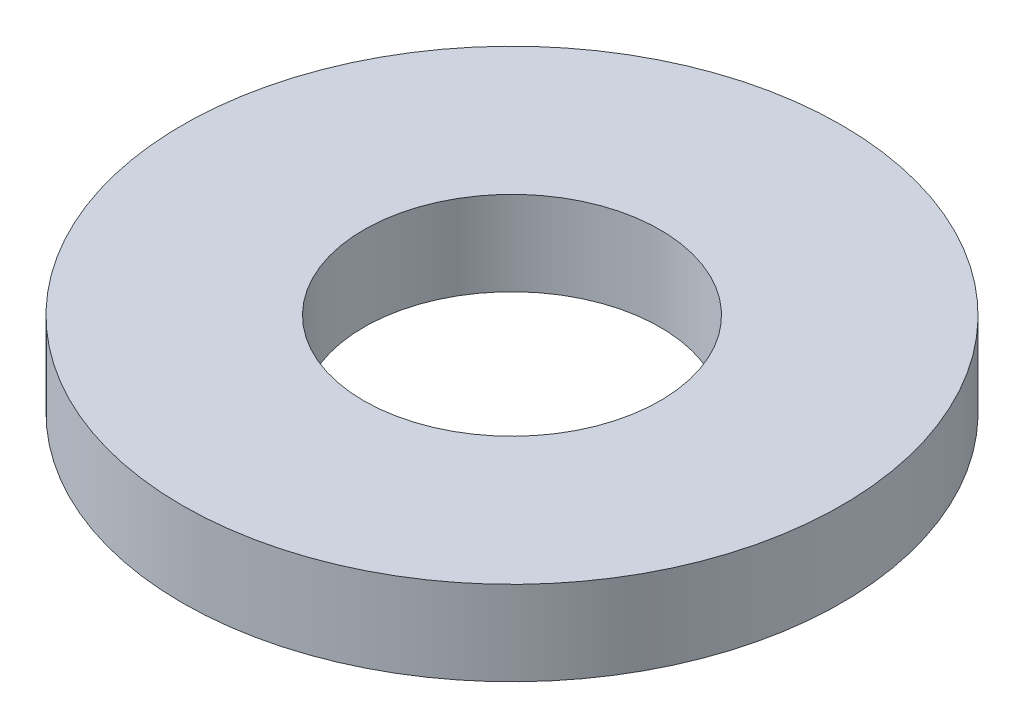
ISO-10303-21;
HEADER;
FILE_DESCRIPTION(('STEP AP214'),'2;1');
FILE_NAME('part.step','',(''),(''),'','','');
FILE_SCHEMA(('AUTOMOTIVE_DESIGN { 1 0 10303 214 1 1 1 1 }'));
ENDSEC;
DATA;
#1=APPLICATION_CONTEXT('core data for automotive mechanical design processes');
#2=APPLICATION_PROTOCOL_DEFINITION('international standard','automotive_design',2000,#1);
#3=PRODUCT_CONTEXT('',#1,'mechanical');
#4=PRODUCT('Part','Part','',(#3));
#5=PRODUCT_RELATED_PRODUCT_CATEGORY('part','',(#4));
#6=PRODUCT_DEFINITION_FORMATION('','',#4);
#7=PRODUCT_DEFINITION_CONTEXT('part definition',#1,'design');
#8=PRODUCT_DEFINITION('design','',#6,#7);
#9=PRODUCT_DEFINITION_SHAPE('','',#8);
#10=(LENGTH_UNIT() NAMED_UNIT(*) SI_UNIT(.MILLI.,.METRE.));
#11=(NAMED_UNIT(*) PLANE_ANGLE_UNIT() SI_UNIT($,.RADIAN.));
#12=(NAMED_UNIT(*) SI_UNIT($,.STERADIAN.) SOLID_ANGLE_UNIT());
#13=UNCERTAINTY_MEASURE_WITH_UNIT(LENGTH_MEASURE(1.E-05),#10,'distance_accuracy_value','');
#14=(GEOMETRIC_REPRESENTATION_CONTEXT(3) GLOBAL_UNCERTAINTY_ASSIGNED_CONTEXT((#13)) GLOBAL_UNIT_ASSIGNED_CONTEXT((#10,
#11,#12)) REPRESENTATION_CONTEXT('',''));
#15=CARTESIAN_POINT('',(0.,0.,0.));
#16=DIRECTION('',(0.,0.,1.));
#17=DIRECTION('',(1.,0.,0.));
#18=AXIS2_PLACEMENT_3D('',#15,#16,#17);
#19=CARTESIAN_POINT('',(0.,2.032,0.));
#20=DIRECTION('',(0.,-1.,0.));
#21=DIRECTION('',(0.,0.,-1.));
#22=AXIS2_PLACEMENT_3D('',#19,#20,#21);
#23=CYLINDRICAL_SURFACE('',#22,7.9375);
#24=CARTESIAN_POINT('',(0.,2.032,0.));
#25=DIRECTION('',(0.,1.,0.));
#26=DIRECTION('',(0.,0.,1.));
#27=AXIS2_PLACEMENT_3D('',#24,#25,#26);
#28=CIRCLE('',#27,7.9375);
#29=CARTESIAN_POINT('',(0.,2.032,7.9375));
#30=VERTEX_POINT('',#29);
#31=EDGE_CURVE('E10',#30,#30,#28,.T.);
#32=ORIENTED_EDGE('',*,*,#31,.F.);
#33=EDGE_LOOP('',(#32));
#34=FACE_BOUND('',#33,.T.);
#35=CARTESIAN_POINT('',(0.,0.,0.));
#36=DIRECTION('',(0.,1.,0.));
#37=DIRECTION('',(0.,0.,1.));
#38=AXIS2_PLACEMENT_3D('',#35,#36,#37);
#39=CIRCLE('',#38,7.9375);
#40=CARTESIAN_POINT('',(0.,0.,7.9375));
#41=VERTEX_POINT('',#40);
#42=EDGE_CURVE('E35',#41,#41,#39,.T.);
#43=ORIENTED_EDGE('',*,*,#42,.T.);
#44=EDGE_LOOP('',(#43));
#45=FACE_BOUND('',#44,.T.);
#46=ADVANCED_FACE('F32',(#34,#45),#23,.T.);
#47=CARTESIAN_POINT('',(0.,2.032,0.));
#48=DIRECTION('',(0.,1.,0.));
#49=DIRECTION('',(0.,0.,1.));
#50=AXIS2_PLACEMENT_3D('',#47,#48,#49);
#51=PLANE('',#50);
#52=CARTESIAN_POINT('',(0.,2.032,0.));
#53=DIRECTION('',(0.,1.,0.));
#54=DIRECTION('',(0.,0.,1.));
#55=AXIS2_PLACEMENT_3D('',#52,#53,#54);
#56=CIRCLE('',#55,3.5687);
#57=CARTESIAN_POINT('',(0.,2.032,3.5687));
#58=VERTEX_POINT('',#57);
#59=EDGE_CURVE('E44',#58,#58,#56,.T.);
#60=ORIENTED_EDGE('',*,*,#59,.F.);
#61=EDGE_LOOP('',(#60));
#62=FACE_BOUND('',#61,.T.);
#63=ORIENTED_EDGE('',*,*,#31,.T.);
#64=EDGE_LOOP('',(#63));
#65=FACE_BOUND('',#64,.T.);
#66=ADVANCED_FACE('F59',(#62,#65),#51,.T.);
#67=CARTESIAN_POINT('',(0.,0.,0.));
#68=DIRECTION('',(0.,1.,0.));
#69=DIRECTION('',(0.,0.,1.));
#70=AXIS2_PLACEMENT_3D('',#67,#68,#69);
#71=PLANE('',#70);
#72=CARTESIAN_POINT('',(0.,0.,0.));
#73=DIRECTION('',(0.,1.,0.));
#74=DIRECTION('',(0.,0.,1.));
#75=AXIS2_PLACEMENT_3D('',#72,#73,#74);
#76=CIRCLE('',#75,3.5687);
#77=CARTESIAN_POINT('',(0.,0.,3.5687));
#78=VERTEX_POINT('',#77);
#79=EDGE_CURVE('E42',#78,#78,#76,.T.);
#80=ORIENTED_EDGE('',*,*,#79,.T.);
#81=EDGE_LOOP('',(#80));
#82=FACE_BOUND('',#81,.T.);
#83=ORIENTED_EDGE('',*,*,#42,.F.);
#84=EDGE_LOOP('',(#83));
#85=FACE_BOUND('',#84,.T.);
#86=ADVANCED_FACE('F50',(#82,#85),#71,.F.);
#87=CARTESIAN_POINT('',(0.,0.,0.));
#88=DIRECTION('',(0.,1.,0.));
#89=DIRECTION('',(0.,0.,1.));
#90=AXIS2_PLACEMENT_3D('',#87,#88,#89);
#91=CYLINDRICAL_SURFACE('',#90,3.5687);
#92=ORIENTED_EDGE('',*,*,#79,.F.);
#93=EDGE_LOOP('',(#92));
#94=FACE_BOUND('',#93,.T.);
#95=ORIENTED_EDGE('',*,*,#59,.T.);
#96=EDGE_LOOP('',(#95));
#97=FACE_BOUND('',#96,.T.);
#98=ADVANCED_FACE('F53',(#94,#97),#91,.F.);
#99=CLOSED_SHELL('',(#46,#66,#86,#98));
#100=MANIFOLD_SOLID_BREP('B2',#99);
#101=ADVANCED_BREP_SHAPE_REPRESENTATION('',(#18,#100),#14);
#102=SHAPE_DEFINITION_REPRESENTATION(#9,#101);
ENDSEC;
END-ISO-10303-21;
